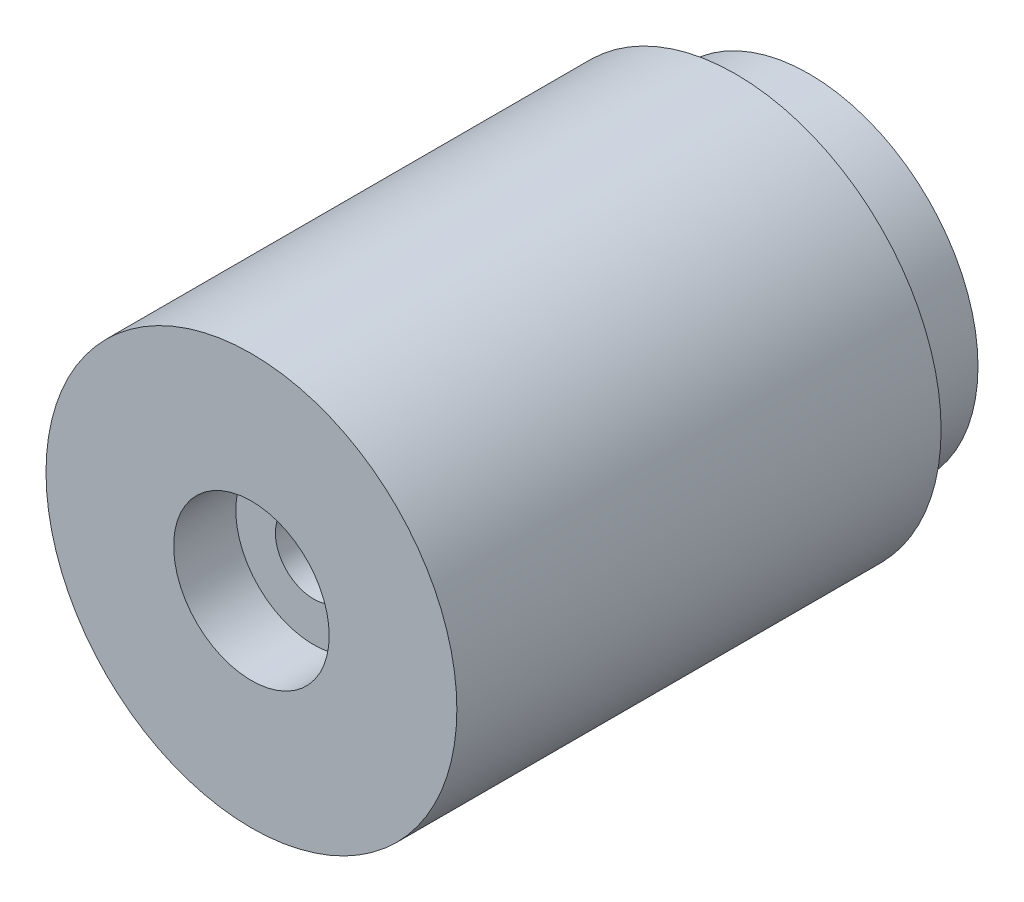
ISO-10303-21;
HEADER;
FILE_DESCRIPTION(('STEP AP214'),'2;1');
FILE_NAME('part.step','',(''),(''),'','','');
FILE_SCHEMA(('AUTOMOTIVE_DESIGN { 1 0 10303 214 1 1 1 1 }'));
ENDSEC;
DATA;
#1=APPLICATION_CONTEXT('core data for automotive mechanical design processes');
#2=APPLICATION_PROTOCOL_DEFINITION('international standard','automotive_design',2000,#1);
#3=PRODUCT_CONTEXT('',#1,'mechanical');
#4=PRODUCT('Part','Part','',(#3));
#5=PRODUCT_RELATED_PRODUCT_CATEGORY('part','',(#4));
#6=PRODUCT_DEFINITION_FORMATION('','',#4);
#7=PRODUCT_DEFINITION_CONTEXT('part definition',#1,'design');
#8=PRODUCT_DEFINITION('design','',#6,#7);
#9=PRODUCT_DEFINITION_SHAPE('','',#8);
#10=(LENGTH_UNIT() NAMED_UNIT(*) SI_UNIT(.MILLI.,.METRE.));
#11=(NAMED_UNIT(*) PLANE_ANGLE_UNIT() SI_UNIT($,.RADIAN.));
#12=(NAMED_UNIT(*) SI_UNIT($,.STERADIAN.) SOLID_ANGLE_UNIT());
#13=UNCERTAINTY_MEASURE_WITH_UNIT(LENGTH_MEASURE(1.E-05),#10,'distance_accuracy_value','');
#14=(GEOMETRIC_REPRESENTATION_CONTEXT(3) GLOBAL_UNCERTAINTY_ASSIGNED_CONTEXT((#13)) GLOBAL_UNIT_ASSIGNED_CONTEXT((#10,
#11,#12)) REPRESENTATION_CONTEXT('',''));
#15=CARTESIAN_POINT('',(0.,0.,0.));
#16=DIRECTION('',(0.,0.,1.));
#17=DIRECTION('',(1.,0.,0.));
#18=AXIS2_PLACEMENT_3D('',#15,#16,#17);
#19=CARTESIAN_POINT('',(0.,0.,49.5));
#20=DIRECTION('',(0.,0.,-1.));
#21=DIRECTION('',(-1.,0.,0.));
#22=AXIS2_PLACEMENT_3D('',#19,#20,#21);
#23=CYLINDRICAL_SURFACE('',#22,3.9);
#24=CARTESIAN_POINT('',(0.,0.,-1.15));
#25=DIRECTION('',(0.,0.,-1.));
#26=DIRECTION('',(-1.,0.,0.));
#27=AXIS2_PLACEMENT_3D('',#24,#25,#26);
#28=CIRCLE('',#27,3.9);
#29=CARTESIAN_POINT('',(-3.9,0.,-1.15));
#30=VERTEX_POINT('',#29);
#31=EDGE_CURVE('E50',#30,#30,#28,.F.);
#32=ORIENTED_EDGE('',*,*,#31,.F.);
#33=EDGE_LOOP('',(#32));
#34=FACE_BOUND('',#33,.T.);
#35=CARTESIAN_POINT('',(0.,0.,43.15));
#36=DIRECTION('',(0.,0.,1.));
#37=DIRECTION('',(1.,0.,0.));
#38=AXIS2_PLACEMENT_3D('',#35,#36,#37);
#39=CIRCLE('',#38,3.9);
#40=CARTESIAN_POINT('',(3.9,0.,43.15));
#41=VERTEX_POINT('',#40);
#42=EDGE_CURVE('E34',#41,#41,#39,.F.);
#43=ORIENTED_EDGE('',*,*,#42,.F.);
#44=EDGE_LOOP('',(#43));
#45=FACE_BOUND('',#44,.T.);
#46=ADVANCED_FACE('F30',(#34,#45),#23,.F.);
#47=CARTESIAN_POINT('',(0.,0.,49.5));
#48=DIRECTION('',(0.,0.,-1.));
#49=DIRECTION('',(-1.,0.,0.));
#50=AXIS2_PLACEMENT_3D('',#47,#48,#49);
#51=CYLINDRICAL_SURFACE('',#50,21.);
#52=CARTESIAN_POINT('',(0.,0.,49.5));
#53=DIRECTION('',(0.,0.,1.));
#54=DIRECTION('',(1.,0.,0.));
#55=AXIS2_PLACEMENT_3D('',#52,#53,#54);
#56=CIRCLE('',#55,21.);
#57=CARTESIAN_POINT('',(21.,0.,49.5));
#58=VERTEX_POINT('',#57);
#59=EDGE_CURVE('E38',#58,#58,#56,.T.);
#60=ORIENTED_EDGE('',*,*,#59,.F.);
#61=EDGE_LOOP('',(#60));
#62=FACE_BOUND('',#61,.T.);
#63=CARTESIAN_POINT('',(0.,0.,0.));
#64=DIRECTION('',(0.,0.,1.));
#65=DIRECTION('',(1.,0.,0.));
#66=AXIS2_PLACEMENT_3D('',#63,#64,#65);
#67=CIRCLE('',#66,21.);
#68=CARTESIAN_POINT('',(21.,0.,0.));
#69=VERTEX_POINT('',#68);
#70=EDGE_CURVE('E43',#69,#69,#67,.T.);
#71=ORIENTED_EDGE('',*,*,#70,.T.);
#72=EDGE_LOOP('',(#71));
#73=FACE_BOUND('',#72,.T.);
#74=ADVANCED_FACE('F32',(#62,#73),#51,.T.);
#75=CARTESIAN_POINT('',(0.,0.,49.5));
#76=DIRECTION('',(0.,0.,1.));
#77=DIRECTION('',(1.,0.,0.));
#78=AXIS2_PLACEMENT_3D('',#75,#76,#77);
#79=PLANE('',#78);
#80=CARTESIAN_POINT('',(0.,0.,49.5));
#81=DIRECTION('',(0.,0.,1.));
#82=DIRECTION('',(1.,0.,0.));
#83=AXIS2_PLACEMENT_3D('',#80,#81,#82);
#84=CIRCLE('',#83,7.95);
#85=CARTESIAN_POINT('',(7.95,0.,49.5));
#86=VERTEX_POINT('',#85);
#87=EDGE_CURVE('E63',#86,#86,#84,.T.);
#88=ORIENTED_EDGE('',*,*,#87,.F.);
#89=EDGE_LOOP('',(#88));
#90=FACE_BOUND('',#89,.T.);
#91=ORIENTED_EDGE('',*,*,#59,.T.);
#92=EDGE_LOOP('',(#91));
#93=FACE_BOUND('',#92,.T.);
#94=ADVANCED_FACE('F81',(#90,#93),#79,.T.);
#95=CARTESIAN_POINT('',(0.,0.,0.));
#96=DIRECTION('',(0.,0.,1.));
#97=DIRECTION('',(1.,0.,0.));
#98=AXIS2_PLACEMENT_3D('',#95,#96,#97);
#99=PLANE('',#98);
#100=CARTESIAN_POINT('',(0.,0.,0.));
#101=DIRECTION('',(0.,0.,-1.));
#102=DIRECTION('',(-1.,0.,0.));
#103=AXIS2_PLACEMENT_3D('',#100,#101,#102);
#104=CIRCLE('',#103,17.272);
#105=CARTESIAN_POINT('',(-17.272,0.,0.));
#106=VERTEX_POINT('',#105);
#107=EDGE_CURVE('E10',#106,#106,#104,.T.);
#108=ORIENTED_EDGE('',*,*,#107,.F.);
#109=EDGE_LOOP('',(#108));
#110=FACE_BOUND('',#109,.T.);
#111=ORIENTED_EDGE('',*,*,#70,.F.);
#112=EDGE_LOOP('',(#111));
#113=FACE_BOUND('',#112,.T.);
#114=ADVANCED_FACE('F88',(#110,#113),#99,.F.);
#115=CARTESIAN_POINT('',(0.,0.,-7.5));
#116=DIRECTION('',(0.,0.,-1.));
#117=DIRECTION('',(-1.,0.,0.));
#118=AXIS2_PLACEMENT_3D('',#115,#116,#117);
#119=PLANE('',#118);
#120=CARTESIAN_POINT('',(0.,0.,-7.5));
#121=DIRECTION('',(0.,0.,-1.));
#122=DIRECTION('',(-1.,0.,0.));
#123=AXIS2_PLACEMENT_3D('',#120,#121,#122);
#124=CIRCLE('',#123,7.95);
#125=CARTESIAN_POINT('',(-7.95,0.,-7.5));
#126=VERTEX_POINT('',#125);
#127=EDGE_CURVE('E57',#126,#126,#124,.T.);
#128=ORIENTED_EDGE('',*,*,#127,.F.);
#129=EDGE_LOOP('',(#128));
#130=FACE_BOUND('',#129,.T.);
#131=CARTESIAN_POINT('',(0.,0.,-7.5));
#132=DIRECTION('',(0.,0.,-1.));
#133=DIRECTION('',(-1.,0.,0.));
#134=AXIS2_PLACEMENT_3D('',#131,#132,#133);
#135=CIRCLE('',#134,17.272);
#136=CARTESIAN_POINT('',(-17.272,0.,-7.5));
#137=VERTEX_POINT('',#136);
#138=EDGE_CURVE('E46',#137,#137,#135,.T.);
#139=ORIENTED_EDGE('',*,*,#138,.T.);
#140=EDGE_LOOP('',(#139));
#141=FACE_BOUND('',#140,.T.);
#142=ADVANCED_FACE('F91',(#130,#141),#119,.T.);
#143=CARTESIAN_POINT('',(0.,0.,-7.5));
#144=DIRECTION('',(0.,0.,1.));
#145=DIRECTION('',(1.,0.,0.));
#146=AXIS2_PLACEMENT_3D('',#143,#144,#145);
#147=CYLINDRICAL_SURFACE('',#146,17.272);
#148=ORIENTED_EDGE('',*,*,#138,.F.);
#149=EDGE_LOOP('',(#148));
#150=FACE_BOUND('',#149,.T.);
#151=ORIENTED_EDGE('',*,*,#107,.T.);
#152=EDGE_LOOP('',(#151));
#153=FACE_BOUND('',#152,.T.);
#154=ADVANCED_FACE('F85',(#150,#153),#147,.T.);
#155=CARTESIAN_POINT('',(0.,0.,-1.15));
#156=DIRECTION('',(0.,0.,-1.));
#157=DIRECTION('',(-1.,0.,0.));
#158=AXIS2_PLACEMENT_3D('',#155,#156,#157);
#159=PLANE('',#158);
#160=CARTESIAN_POINT('',(0.,0.,-1.15));
#161=DIRECTION('',(0.,0.,-1.));
#162=DIRECTION('',(-1.,0.,0.));
#163=AXIS2_PLACEMENT_3D('',#160,#161,#162);
#164=CIRCLE('',#163,7.95);
#165=CARTESIAN_POINT('',(-7.95,0.,-1.15));
#166=VERTEX_POINT('',#165);
#167=EDGE_CURVE('E52',#166,#166,#164,.T.);
#168=ORIENTED_EDGE('',*,*,#167,.T.);
#169=EDGE_LOOP('',(#168));
#170=FACE_BOUND('',#169,.T.);
#171=ORIENTED_EDGE('',*,*,#31,.T.);
#172=EDGE_LOOP('',(#171));
#173=FACE_BOUND('',#172,.T.);
#174=ADVANCED_FACE('F103',(#170,#173),#159,.T.);
#175=CARTESIAN_POINT('',(0.,0.,-1.15));
#176=DIRECTION('',(0.,0.,-1.));
#177=DIRECTION('',(-1.,0.,0.));
#178=AXIS2_PLACEMENT_3D('',#175,#176,#177);
#179=CYLINDRICAL_SURFACE('',#178,7.95);
#180=ORIENTED_EDGE('',*,*,#167,.F.);
#181=EDGE_LOOP('',(#180));
#182=FACE_BOUND('',#181,.T.);
#183=ORIENTED_EDGE('',*,*,#127,.T.);
#184=EDGE_LOOP('',(#183));
#185=FACE_BOUND('',#184,.T.);
#186=ADVANCED_FACE('F108',(#182,#185),#179,.F.);
#187=CARTESIAN_POINT('',(0.,0.,43.15));
#188=DIRECTION('',(0.,0.,1.));
#189=DIRECTION('',(1.,0.,0.));
#190=AXIS2_PLACEMENT_3D('',#187,#188,#189);
#191=PLANE('',#190);
#192=CARTESIAN_POINT('',(0.,0.,43.15));
#193=DIRECTION('',(0.,0.,1.));
#194=DIRECTION('',(1.,0.,0.));
#195=AXIS2_PLACEMENT_3D('',#192,#193,#194);
#196=CIRCLE('',#195,7.95);
#197=CARTESIAN_POINT('',(7.95,0.,43.15));
#198=VERTEX_POINT('',#197);
#199=EDGE_CURVE('E66',#198,#198,#196,.T.);
#200=ORIENTED_EDGE('',*,*,#199,.T.);
#201=EDGE_LOOP('',(#200));
#202=FACE_BOUND('',#201,.T.);
#203=ORIENTED_EDGE('',*,*,#42,.T.);
#204=EDGE_LOOP('',(#203));
#205=FACE_BOUND('',#204,.T.);
#206=ADVANCED_FACE('F73',(#202,#205),#191,.T.);
#207=CARTESIAN_POINT('',(0.,0.,43.15));
#208=DIRECTION('',(0.,0.,1.));
#209=DIRECTION('',(1.,0.,0.));
#210=AXIS2_PLACEMENT_3D('',#207,#208,#209);
#211=CYLINDRICAL_SURFACE('',#210,7.95);
#212=ORIENTED_EDGE('',*,*,#199,.F.);
#213=EDGE_LOOP('',(#212));
#214=FACE_BOUND('',#213,.T.);
#215=ORIENTED_EDGE('',*,*,#87,.T.);
#216=EDGE_LOOP('',(#215));
#217=FACE_BOUND('',#216,.T.);
#218=ADVANCED_FACE('F114',(#214,#217),#211,.F.);
#219=CLOSED_SHELL('',(#46,#74,#94,#114,#142,#154,#174,#186,#206,#218));
#220=MANIFOLD_SOLID_BREP('B2',#219);
#221=ADVANCED_BREP_SHAPE_REPRESENTATION('',(#18,#220),#14);
#222=SHAPE_DEFINITION_REPRESENTATION(#9,#221);
ENDSEC;
END-ISO-10303-21;
